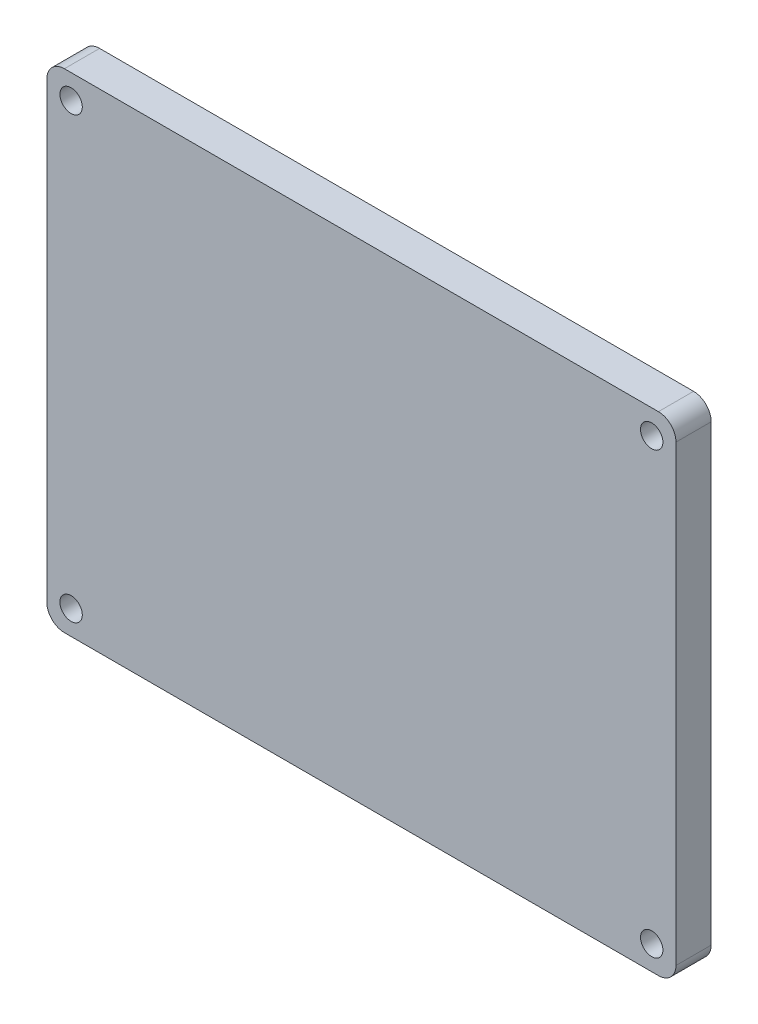
ISO-10303-21;
HEADER;
FILE_DESCRIPTION(('STEP AP214'),'2;1');
FILE_NAME('part.step','',(''),(''),'','','');
FILE_SCHEMA(('AUTOMOTIVE_DESIGN { 1 0 10303 214 1 1 1 1 }'));
ENDSEC;
DATA;
#1=APPLICATION_CONTEXT('core data for automotive mechanical design processes');
#2=APPLICATION_PROTOCOL_DEFINITION('international standard','automotive_design',2000,#1);
#3=PRODUCT_CONTEXT('',#1,'mechanical');
#4=PRODUCT('Part','Part','',(#3));
#5=PRODUCT_RELATED_PRODUCT_CATEGORY('part','',(#4));
#6=PRODUCT_DEFINITION_FORMATION('','',#4);
#7=PRODUCT_DEFINITION_CONTEXT('part definition',#1,'design');
#8=PRODUCT_DEFINITION('design','',#6,#7);
#9=PRODUCT_DEFINITION_SHAPE('','',#8);
#10=(LENGTH_UNIT() NAMED_UNIT(*) SI_UNIT(.MILLI.,.METRE.));
#11=(NAMED_UNIT(*) PLANE_ANGLE_UNIT() SI_UNIT($,.RADIAN.));
#12=(NAMED_UNIT(*) SI_UNIT($,.STERADIAN.) SOLID_ANGLE_UNIT());
#13=UNCERTAINTY_MEASURE_WITH_UNIT(LENGTH_MEASURE(1.E-05),#10,'distance_accuracy_value','');
#14=(GEOMETRIC_REPRESENTATION_CONTEXT(3) GLOBAL_UNCERTAINTY_ASSIGNED_CONTEXT((#13)) GLOBAL_UNIT_ASSIGNED_CONTEXT((#10,
#11,#12)) REPRESENTATION_CONTEXT('',''));
#15=CARTESIAN_POINT('',(0.,0.,0.));
#16=DIRECTION('',(0.,0.,1.));
#17=DIRECTION('',(1.,0.,0.));
#18=AXIS2_PLACEMENT_3D('',#15,#16,#17);
#19=CARTESIAN_POINT('',(-56.769,44.069,6.35));
#20=DIRECTION('',(1.,0.,0.));
#21=DIRECTION('',(0.,1.,0.));
#22=AXIS2_PLACEMENT_3D('',#19,#20,#21);
#23=PLANE('',#22);
#24=DIRECTION('',(0.,-1.,0.));
#25=VECTOR('',#24,1.);
#26=CARTESIAN_POINT('',(-56.769,44.069,0.));
#27=LINE('',#26,#25);
#28=CARTESIAN_POINT('',(-56.769,40.894,0.));
#29=VERTEX_POINT('',#28);
#30=CARTESIAN_POINT('',(-56.769,-40.894,0.));
#31=VERTEX_POINT('',#30);
#32=EDGE_CURVE('E131',#29,#31,#27,.T.);
#33=ORIENTED_EDGE('',*,*,#32,.T.);
#34=DIRECTION('',(0.,0.,-1.));
#35=VECTOR('',#34,1.);
#36=CARTESIAN_POINT('',(-56.769,-40.894,6.35));
#37=LINE('',#36,#35);
#38=CARTESIAN_POINT('',(-56.769,-40.894,6.35));
#39=VERTEX_POINT('',#38);
#40=EDGE_CURVE('E109',#31,#39,#37,.F.);
#41=ORIENTED_EDGE('',*,*,#40,.T.);
#42=DIRECTION('',(0.,-1.,0.));
#43=VECTOR('',#42,1.);
#44=CARTESIAN_POINT('',(-56.769,44.069,6.35));
#45=LINE('',#44,#43);
#46=CARTESIAN_POINT('',(-56.769,40.894,6.35));
#47=VERTEX_POINT('',#46);
#48=EDGE_CURVE('E141',#47,#39,#45,.T.);
#49=ORIENTED_EDGE('',*,*,#48,.F.);
#50=DIRECTION('',(0.,0.,-1.));
#51=VECTOR('',#50,1.);
#52=CARTESIAN_POINT('',(-56.769,40.894,6.35));
#53=LINE('',#52,#51);
#54=EDGE_CURVE('E114',#47,#29,#53,.T.);
#55=ORIENTED_EDGE('',*,*,#54,.T.);
#56=EDGE_LOOP('',(#33,#41,#49,#55));
#57=FACE_BOUND('',#56,.T.);
#58=ADVANCED_FACE('F38',(#57),#23,.F.);
#59=CARTESIAN_POINT('',(-56.769,-44.069,6.35));
#60=DIRECTION('',(0.,1.,0.));
#61=DIRECTION('',(-1.,0.,0.));
#62=AXIS2_PLACEMENT_3D('',#59,#60,#61);
#63=PLANE('',#62);
#64=DIRECTION('',(1.,0.,0.));
#65=VECTOR('',#64,1.);
#66=CARTESIAN_POINT('',(-56.769,-44.069,6.35));
#67=LINE('',#66,#65);
#68=CARTESIAN_POINT('',(-53.594,-44.069,6.35));
#69=VERTEX_POINT('',#68);
#70=CARTESIAN_POINT('',(53.594,-44.069,6.35));
#71=VERTEX_POINT('',#70);
#72=EDGE_CURVE('E124',#69,#71,#67,.T.);
#73=ORIENTED_EDGE('',*,*,#72,.F.);
#74=DIRECTION('',(0.,0.,-1.));
#75=VECTOR('',#74,1.);
#76=CARTESIAN_POINT('',(-53.594,-44.069,6.35));
#77=LINE('',#76,#75);
#78=CARTESIAN_POINT('',(-53.594,-44.069,0.));
#79=VERTEX_POINT('',#78);
#80=EDGE_CURVE('E108',#69,#79,#77,.T.);
#81=ORIENTED_EDGE('',*,*,#80,.T.);
#82=DIRECTION('',(1.,0.,0.));
#83=VECTOR('',#82,1.);
#84=CARTESIAN_POINT('',(-56.769,-44.069,0.));
#85=LINE('',#84,#83);
#86=CARTESIAN_POINT('',(53.594,-44.069,0.));
#87=VERTEX_POINT('',#86);
#88=EDGE_CURVE('E121',#79,#87,#85,.T.);
#89=ORIENTED_EDGE('',*,*,#88,.T.);
#90=DIRECTION('',(0.,0.,-1.));
#91=VECTOR('',#90,1.);
#92=CARTESIAN_POINT('',(53.594,-44.069,6.35));
#93=LINE('',#92,#91);
#94=EDGE_CURVE('E126',#87,#71,#93,.F.);
#95=ORIENTED_EDGE('',*,*,#94,.T.);
#96=EDGE_LOOP('',(#73,#81,#89,#95));
#97=FACE_BOUND('',#96,.T.);
#98=ADVANCED_FACE('F120',(#97),#63,.F.);
#99=CARTESIAN_POINT('',(56.769,44.069,6.35));
#100=DIRECTION('',(-1.,0.,0.));
#101=DIRECTION('',(0.,-1.,0.));
#102=AXIS2_PLACEMENT_3D('',#99,#100,#101);
#103=PLANE('',#102);
#104=DIRECTION('',(0.,1.,0.));
#105=VECTOR('',#104,1.);
#106=CARTESIAN_POINT('',(56.769,44.069,6.35));
#107=LINE('',#106,#105);
#108=CARTESIAN_POINT('',(56.769,-40.894,6.35));
#109=VERTEX_POINT('',#108);
#110=CARTESIAN_POINT('',(56.769,40.894,6.35));
#111=VERTEX_POINT('',#110);
#112=EDGE_CURVE('E167',#109,#111,#107,.T.);
#113=ORIENTED_EDGE('',*,*,#112,.F.);
#114=DIRECTION('',(0.,0.,-1.));
#115=VECTOR('',#114,1.);
#116=CARTESIAN_POINT('',(56.769,-40.894,6.35));
#117=LINE('',#116,#115);
#118=CARTESIAN_POINT('',(56.769,-40.894,0.));
#119=VERTEX_POINT('',#118);
#120=EDGE_CURVE('E160',#109,#119,#117,.T.);
#121=ORIENTED_EDGE('',*,*,#120,.T.);
#122=DIRECTION('',(0.,1.,0.));
#123=VECTOR('',#122,1.);
#124=CARTESIAN_POINT('',(56.769,44.069,0.));
#125=LINE('',#124,#123);
#126=CARTESIAN_POINT('',(56.769,40.894,0.));
#127=VERTEX_POINT('',#126);
#128=EDGE_CURVE('E130',#119,#127,#125,.T.);
#129=ORIENTED_EDGE('',*,*,#128,.T.);
#130=DIRECTION('',(0.,0.,-1.));
#131=VECTOR('',#130,1.);
#132=CARTESIAN_POINT('',(56.769,40.894,6.35));
#133=LINE('',#132,#131);
#134=EDGE_CURVE('E158',#127,#111,#133,.F.);
#135=ORIENTED_EDGE('',*,*,#134,.T.);
#136=EDGE_LOOP('',(#113,#121,#129,#135));
#137=FACE_BOUND('',#136,.T.);
#138=ADVANCED_FACE('F165',(#137),#103,.F.);
#139=CARTESIAN_POINT('',(-56.769,44.069,6.35));
#140=DIRECTION('',(0.,-1.,0.));
#141=DIRECTION('',(1.,0.,0.));
#142=AXIS2_PLACEMENT_3D('',#139,#140,#141);
#143=PLANE('',#142);
#144=DIRECTION('',(-1.,0.,0.));
#145=VECTOR('',#144,1.);
#146=CARTESIAN_POINT('',(-56.769,44.069,6.35));
#147=LINE('',#146,#145);
#148=CARTESIAN_POINT('',(53.594,44.069,6.35));
#149=VERTEX_POINT('',#148);
#150=CARTESIAN_POINT('',(-53.594,44.069,6.35));
#151=VERTEX_POINT('',#150);
#152=EDGE_CURVE('E142',#149,#151,#147,.T.);
#153=ORIENTED_EDGE('',*,*,#152,.F.);
#154=DIRECTION('',(0.,0.,-1.));
#155=VECTOR('',#154,1.);
#156=CARTESIAN_POINT('',(53.594,44.069,6.35));
#157=LINE('',#156,#155);
#158=CARTESIAN_POINT('',(53.594,44.069,0.));
#159=VERTEX_POINT('',#158);
#160=EDGE_CURVE('E11',#149,#159,#157,.T.);
#161=ORIENTED_EDGE('',*,*,#160,.T.);
#162=DIRECTION('',(-1.,0.,0.));
#163=VECTOR('',#162,1.);
#164=CARTESIAN_POINT('',(-56.769,44.069,0.));
#165=LINE('',#164,#163);
#166=CARTESIAN_POINT('',(-53.594,44.069,0.));
#167=VERTEX_POINT('',#166);
#168=EDGE_CURVE('E134',#159,#167,#165,.T.);
#169=ORIENTED_EDGE('',*,*,#168,.T.);
#170=DIRECTION('',(0.,0.,-1.));
#171=VECTOR('',#170,1.);
#172=CARTESIAN_POINT('',(-53.594,44.069,6.35));
#173=LINE('',#172,#171);
#174=EDGE_CURVE('E46',#167,#151,#173,.F.);
#175=ORIENTED_EDGE('',*,*,#174,.T.);
#176=EDGE_LOOP('',(#153,#161,#169,#175));
#177=FACE_BOUND('',#176,.T.);
#178=ADVANCED_FACE('F174',(#177),#143,.F.);
#179=CARTESIAN_POINT('',(-56.769,-44.069,6.35));
#180=DIRECTION('',(0.,0.,1.));
#181=DIRECTION('',(1.,0.,0.));
#182=AXIS2_PLACEMENT_3D('',#179,#180,#181);
#183=PLANE('',#182);
#184=CARTESIAN_POINT('',(-52.3875,39.6875,6.35));
#185=DIRECTION('',(0.,0.,1.));
#186=DIRECTION('',(1.,0.,0.));
#187=AXIS2_PLACEMENT_3D('',#184,#185,#186);
#188=CIRCLE('',#187,2.0193);
#189=CARTESIAN_POINT('',(-50.3682,39.6875,6.35));
#190=VERTEX_POINT('',#189);
#191=EDGE_CURVE('E201',#190,#190,#188,.T.);
#192=ORIENTED_EDGE('',*,*,#191,.F.);
#193=EDGE_LOOP('',(#192));
#194=FACE_BOUND('',#193,.T.);
#195=CARTESIAN_POINT('',(52.3875,39.6875,6.35));
#196=DIRECTION('',(0.,0.,1.));
#197=DIRECTION('',(1.,0.,0.));
#198=AXIS2_PLACEMENT_3D('',#195,#196,#197);
#199=CIRCLE('',#198,2.0193);
#200=CARTESIAN_POINT('',(54.4068,39.6875,6.35));
#201=VERTEX_POINT('',#200);
#202=EDGE_CURVE('E195',#201,#201,#199,.T.);
#203=ORIENTED_EDGE('',*,*,#202,.F.);
#204=EDGE_LOOP('',(#203));
#205=FACE_BOUND('',#204,.T.);
#206=CARTESIAN_POINT('',(52.3875,-39.6875,6.35));
#207=DIRECTION('',(0.,0.,1.));
#208=DIRECTION('',(1.,0.,0.));
#209=AXIS2_PLACEMENT_3D('',#206,#207,#208);
#210=CIRCLE('',#209,2.0193);
#211=CARTESIAN_POINT('',(54.4068,-39.6875,6.35));
#212=VERTEX_POINT('',#211);
#213=EDGE_CURVE('E189',#212,#212,#210,.T.);
#214=ORIENTED_EDGE('',*,*,#213,.F.);
#215=EDGE_LOOP('',(#214));
#216=FACE_BOUND('',#215,.T.);
#217=CARTESIAN_POINT('',(-52.3875,-39.6875,6.35));
#218=DIRECTION('',(0.,0.,1.));
#219=DIRECTION('',(1.,0.,0.));
#220=AXIS2_PLACEMENT_3D('',#217,#218,#219);
#221=CIRCLE('',#220,2.0193);
#222=CARTESIAN_POINT('',(-50.3682,-39.6875,6.35));
#223=VERTEX_POINT('',#222);
#224=EDGE_CURVE('E183',#223,#223,#221,.T.);
#225=ORIENTED_EDGE('',*,*,#224,.F.);
#226=EDGE_LOOP('',(#225));
#227=FACE_BOUND('',#226,.T.);
#228=ORIENTED_EDGE('',*,*,#48,.T.);
#229=CARTESIAN_POINT('',(-53.594,-40.894,6.35));
#230=DIRECTION('',(0.,0.,1.));
#231=DIRECTION('',(1.,0.,0.));
#232=AXIS2_PLACEMENT_3D('',#229,#230,#231);
#233=CIRCLE('',#232,3.175);
#234=EDGE_CURVE('E156',#39,#69,#233,.T.);
#235=ORIENTED_EDGE('',*,*,#234,.T.);
#236=ORIENTED_EDGE('',*,*,#72,.T.);
#237=CARTESIAN_POINT('',(53.594,-40.894,6.35));
#238=DIRECTION('',(0.,0.,1.));
#239=DIRECTION('',(1.,0.,0.));
#240=AXIS2_PLACEMENT_3D('',#237,#238,#239);
#241=CIRCLE('',#240,3.175);
#242=EDGE_CURVE('E154',#71,#109,#241,.T.);
#243=ORIENTED_EDGE('',*,*,#242,.T.);
#244=ORIENTED_EDGE('',*,*,#112,.T.);
#245=CARTESIAN_POINT('',(53.594,40.894,6.35));
#246=DIRECTION('',(0.,0.,1.));
#247=DIRECTION('',(1.,0.,0.));
#248=AXIS2_PLACEMENT_3D('',#245,#246,#247);
#249=CIRCLE('',#248,3.175);
#250=EDGE_CURVE('E59',#111,#149,#249,.T.);
#251=ORIENTED_EDGE('',*,*,#250,.T.);
#252=ORIENTED_EDGE('',*,*,#152,.T.);
#253=CARTESIAN_POINT('',(-53.594,40.894,6.35));
#254=DIRECTION('',(0.,0.,1.));
#255=DIRECTION('',(1.,0.,0.));
#256=AXIS2_PLACEMENT_3D('',#253,#254,#255);
#257=CIRCLE('',#256,3.175);
#258=EDGE_CURVE('E151',#151,#47,#257,.T.);
#259=ORIENTED_EDGE('',*,*,#258,.T.);
#260=EDGE_LOOP('',(#228,#235,#236,#243,#244,#251,#252,#259));
#261=FACE_BOUND('',#260,.T.);
#262=ADVANCED_FACE('F207',(#194,#205,#216,#227,#261),#183,.T.);
#263=CARTESIAN_POINT('',(-56.769,-44.069,0.));
#264=DIRECTION('',(0.,0.,1.));
#265=DIRECTION('',(1.,0.,0.));
#266=AXIS2_PLACEMENT_3D('',#263,#264,#265);
#267=PLANE('',#266);
#268=CARTESIAN_POINT('',(-52.3875,39.6875,0.));
#269=DIRECTION('',(0.,0.,1.));
#270=DIRECTION('',(1.,0.,0.));
#271=AXIS2_PLACEMENT_3D('',#268,#269,#270);
#272=CIRCLE('',#271,2.0193);
#273=CARTESIAN_POINT('',(-50.3682,39.6875,0.));
#274=VERTEX_POINT('',#273);
#275=EDGE_CURVE('E198',#274,#274,#272,.T.);
#276=ORIENTED_EDGE('',*,*,#275,.T.);
#277=EDGE_LOOP('',(#276));
#278=FACE_BOUND('',#277,.T.);
#279=CARTESIAN_POINT('',(52.3875,39.6875,0.));
#280=DIRECTION('',(0.,0.,1.));
#281=DIRECTION('',(1.,0.,0.));
#282=AXIS2_PLACEMENT_3D('',#279,#280,#281);
#283=CIRCLE('',#282,2.0193);
#284=CARTESIAN_POINT('',(54.4068,39.6875,0.));
#285=VERTEX_POINT('',#284);
#286=EDGE_CURVE('E192',#285,#285,#283,.T.);
#287=ORIENTED_EDGE('',*,*,#286,.T.);
#288=EDGE_LOOP('',(#287));
#289=FACE_BOUND('',#288,.T.);
#290=CARTESIAN_POINT('',(52.3875,-39.6875,0.));
#291=DIRECTION('',(0.,0.,1.));
#292=DIRECTION('',(1.,0.,0.));
#293=AXIS2_PLACEMENT_3D('',#290,#291,#292);
#294=CIRCLE('',#293,2.0193);
#295=CARTESIAN_POINT('',(54.4068,-39.6875,0.));
#296=VERTEX_POINT('',#295);
#297=EDGE_CURVE('E186',#296,#296,#294,.T.);
#298=ORIENTED_EDGE('',*,*,#297,.T.);
#299=EDGE_LOOP('',(#298));
#300=FACE_BOUND('',#299,.T.);
#301=CARTESIAN_POINT('',(-52.3875,-39.6875,0.));
#302=DIRECTION('',(0.,0.,1.));
#303=DIRECTION('',(1.,0.,0.));
#304=AXIS2_PLACEMENT_3D('',#301,#302,#303);
#305=CIRCLE('',#304,2.0193);
#306=CARTESIAN_POINT('',(-50.3682,-39.6875,0.));
#307=VERTEX_POINT('',#306);
#308=EDGE_CURVE('E136',#307,#307,#305,.T.);
#309=ORIENTED_EDGE('',*,*,#308,.T.);
#310=EDGE_LOOP('',(#309));
#311=FACE_BOUND('',#310,.T.);
#312=ORIENTED_EDGE('',*,*,#88,.F.);
#313=CARTESIAN_POINT('',(-53.594,-40.894,0.));
#314=DIRECTION('',(0.,0.,1.));
#315=DIRECTION('',(1.,0.,0.));
#316=AXIS2_PLACEMENT_3D('',#313,#314,#315);
#317=CIRCLE('',#316,3.175);
#318=EDGE_CURVE('E104',#79,#31,#317,.F.);
#319=ORIENTED_EDGE('',*,*,#318,.T.);
#320=ORIENTED_EDGE('',*,*,#32,.F.);
#321=CARTESIAN_POINT('',(-53.594,40.894,0.));
#322=DIRECTION('',(0.,0.,1.));
#323=DIRECTION('',(1.,0.,0.));
#324=AXIS2_PLACEMENT_3D('',#321,#322,#323);
#325=CIRCLE('',#324,3.175);
#326=EDGE_CURVE('E125',#29,#167,#325,.F.);
#327=ORIENTED_EDGE('',*,*,#326,.T.);
#328=ORIENTED_EDGE('',*,*,#168,.F.);
#329=CARTESIAN_POINT('',(53.594,40.894,0.));
#330=DIRECTION('',(0.,0.,1.));
#331=DIRECTION('',(1.,0.,0.));
#332=AXIS2_PLACEMENT_3D('',#329,#330,#331);
#333=CIRCLE('',#332,3.175);
#334=EDGE_CURVE('E145',#159,#127,#333,.F.);
#335=ORIENTED_EDGE('',*,*,#334,.T.);
#336=ORIENTED_EDGE('',*,*,#128,.F.);
#337=CARTESIAN_POINT('',(53.594,-40.894,0.));
#338=DIRECTION('',(0.,0.,1.));
#339=DIRECTION('',(1.,0.,0.));
#340=AXIS2_PLACEMENT_3D('',#337,#338,#339);
#341=CIRCLE('',#340,3.175);
#342=EDGE_CURVE('E115',#119,#87,#341,.F.);
#343=ORIENTED_EDGE('',*,*,#342,.T.);
#344=EDGE_LOOP('',(#312,#319,#320,#327,#328,#335,#336,#343));
#345=FACE_BOUND('',#344,.T.);
#346=ADVANCED_FACE('F128',(#278,#289,#300,#311,#345),#267,.F.);
#347=CARTESIAN_POINT('',(-52.3875,-39.6875,6.35));
#348=DIRECTION('',(0.,0.,1.));
#349=DIRECTION('',(1.,0.,0.));
#350=AXIS2_PLACEMENT_3D('',#347,#348,#349);
#351=CYLINDRICAL_SURFACE('',#350,2.0193);
#352=ORIENTED_EDGE('',*,*,#308,.F.);
#353=EDGE_LOOP('',(#352));
#354=FACE_BOUND('',#353,.T.);
#355=ORIENTED_EDGE('',*,*,#224,.T.);
#356=EDGE_LOOP('',(#355));
#357=FACE_BOUND('',#356,.T.);
#358=ADVANCED_FACE('F257',(#354,#357),#351,.F.);
#359=CARTESIAN_POINT('',(52.3875,-39.6875,6.35));
#360=DIRECTION('',(0.,0.,1.));
#361=DIRECTION('',(1.,0.,0.));
#362=AXIS2_PLACEMENT_3D('',#359,#360,#361);
#363=CYLINDRICAL_SURFACE('',#362,2.0193);
#364=ORIENTED_EDGE('',*,*,#297,.F.);
#365=EDGE_LOOP('',(#364));
#366=FACE_BOUND('',#365,.T.);
#367=ORIENTED_EDGE('',*,*,#213,.T.);
#368=EDGE_LOOP('',(#367));
#369=FACE_BOUND('',#368,.T.);
#370=ADVANCED_FACE('F251',(#366,#369),#363,.F.);
#371=CARTESIAN_POINT('',(52.3875,39.6875,6.35));
#372=DIRECTION('',(0.,0.,1.));
#373=DIRECTION('',(1.,0.,0.));
#374=AXIS2_PLACEMENT_3D('',#371,#372,#373);
#375=CYLINDRICAL_SURFACE('',#374,2.0193);
#376=ORIENTED_EDGE('',*,*,#286,.F.);
#377=EDGE_LOOP('',(#376));
#378=FACE_BOUND('',#377,.T.);
#379=ORIENTED_EDGE('',*,*,#202,.T.);
#380=EDGE_LOOP('',(#379));
#381=FACE_BOUND('',#380,.T.);
#382=ADVANCED_FACE('F256',(#378,#381),#375,.F.);
#383=CARTESIAN_POINT('',(-52.3875,39.6875,6.35));
#384=DIRECTION('',(0.,0.,1.));
#385=DIRECTION('',(1.,0.,0.));
#386=AXIS2_PLACEMENT_3D('',#383,#384,#385);
#387=CYLINDRICAL_SURFACE('',#386,2.0193);
#388=ORIENTED_EDGE('',*,*,#275,.F.);
#389=EDGE_LOOP('',(#388));
#390=FACE_BOUND('',#389,.T.);
#391=ORIENTED_EDGE('',*,*,#191,.T.);
#392=EDGE_LOOP('',(#391));
#393=FACE_BOUND('',#392,.T.);
#394=ADVANCED_FACE('F205',(#390,#393),#387,.F.);
#395=CARTESIAN_POINT('',(-53.594,-40.894,6.35));
#396=DIRECTION('',(0.,0.,-1.));
#397=DIRECTION('',(-1.,0.,0.));
#398=AXIS2_PLACEMENT_3D('',#395,#396,#397);
#399=CYLINDRICAL_SURFACE('',#398,3.175);
#400=ORIENTED_EDGE('',*,*,#234,.F.);
#401=ORIENTED_EDGE('',*,*,#40,.F.);
#402=ORIENTED_EDGE('',*,*,#318,.F.);
#403=ORIENTED_EDGE('',*,*,#80,.F.);
#404=EDGE_LOOP('',(#400,#401,#402,#403));
#405=FACE_BOUND('',#404,.T.);
#406=ADVANCED_FACE('F107',(#405),#399,.T.);
#407=CARTESIAN_POINT('',(53.594,-40.894,6.35));
#408=DIRECTION('',(0.,0.,-1.));
#409=DIRECTION('',(-1.,0.,0.));
#410=AXIS2_PLACEMENT_3D('',#407,#408,#409);
#411=CYLINDRICAL_SURFACE('',#410,3.175);
#412=ORIENTED_EDGE('',*,*,#242,.F.);
#413=ORIENTED_EDGE('',*,*,#94,.F.);
#414=ORIENTED_EDGE('',*,*,#342,.F.);
#415=ORIENTED_EDGE('',*,*,#120,.F.);
#416=EDGE_LOOP('',(#412,#413,#414,#415));
#417=FACE_BOUND('',#416,.T.);
#418=ADVANCED_FACE('F224',(#417),#411,.T.);
#419=CARTESIAN_POINT('',(53.594,40.894,6.35));
#420=DIRECTION('',(0.,0.,-1.));
#421=DIRECTION('',(-1.,0.,0.));
#422=AXIS2_PLACEMENT_3D('',#419,#420,#421);
#423=CYLINDRICAL_SURFACE('',#422,3.175);
#424=ORIENTED_EDGE('',*,*,#250,.F.);
#425=ORIENTED_EDGE('',*,*,#134,.F.);
#426=ORIENTED_EDGE('',*,*,#334,.F.);
#427=ORIENTED_EDGE('',*,*,#160,.F.);
#428=EDGE_LOOP('',(#424,#425,#426,#427));
#429=FACE_BOUND('',#428,.T.);
#430=ADVANCED_FACE('F173',(#429),#423,.T.);
#431=CARTESIAN_POINT('',(-53.594,40.894,6.35));
#432=DIRECTION('',(0.,0.,-1.));
#433=DIRECTION('',(-1.,0.,0.));
#434=AXIS2_PLACEMENT_3D('',#431,#432,#433);
#435=CYLINDRICAL_SURFACE('',#434,3.175);
#436=ORIENTED_EDGE('',*,*,#258,.F.);
#437=ORIENTED_EDGE('',*,*,#174,.F.);
#438=ORIENTED_EDGE('',*,*,#326,.F.);
#439=ORIENTED_EDGE('',*,*,#54,.F.);
#440=EDGE_LOOP('',(#436,#437,#438,#439));
#441=FACE_BOUND('',#440,.T.);
#442=ADVANCED_FACE('F40',(#441),#435,.T.);
#443=CLOSED_SHELL('',(#58,#98,#138,#178,#262,#346,#358,#370,#382,#394,#406,#418,#430,#442));
#444=MANIFOLD_SOLID_BREP('B2',#443);
#445=ADVANCED_BREP_SHAPE_REPRESENTATION('',(#18,#444),#14);
#446=SHAPE_DEFINITION_REPRESENTATION(#9,#445);
ENDSEC;
END-ISO-10303-21;
